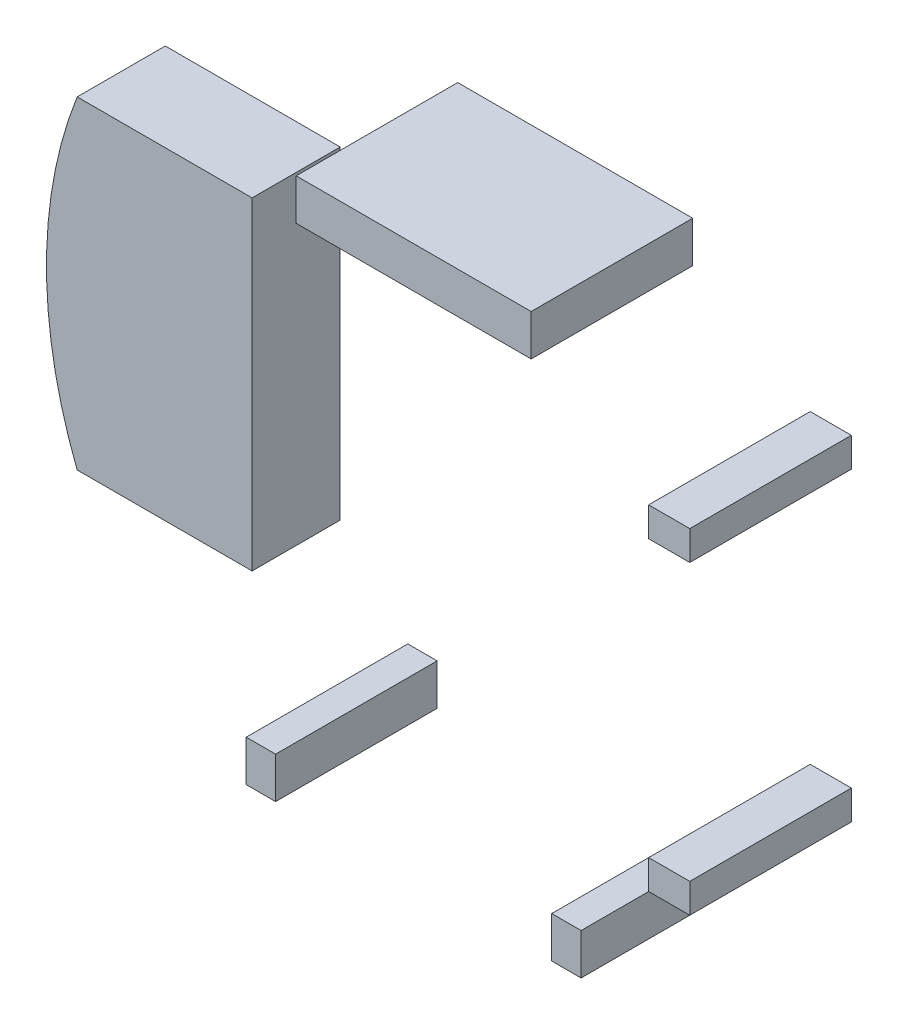
ISO-10303-21;
HEADER;
FILE_DESCRIPTION(('STEP AP214'),'2;1');
FILE_NAME('part.step','',(''),(''),'','','');
FILE_SCHEMA(('AUTOMOTIVE_DESIGN { 1 0 10303 214 1 1 1 1 }'));
ENDSEC;
DATA;
#1=APPLICATION_CONTEXT('core data for automotive mechanical design processes');
#2=APPLICATION_PROTOCOL_DEFINITION('international standard','automotive_design',2000,#1);
#3=PRODUCT_CONTEXT('',#1,'mechanical');
#4=PRODUCT('Part','Part','',(#3));
#5=PRODUCT_RELATED_PRODUCT_CATEGORY('part','',(#4));
#6=PRODUCT_DEFINITION_FORMATION('','',#4);
#7=PRODUCT_DEFINITION_CONTEXT('part definition',#1,'design');
#8=PRODUCT_DEFINITION('design','',#6,#7);
#9=PRODUCT_DEFINITION_SHAPE('','',#8);
#10=(LENGTH_UNIT() NAMED_UNIT(*) SI_UNIT(.MILLI.,.METRE.));
#11=(NAMED_UNIT(*) PLANE_ANGLE_UNIT() SI_UNIT($,.RADIAN.));
#12=(NAMED_UNIT(*) SI_UNIT($,.STERADIAN.) SOLID_ANGLE_UNIT());
#13=UNCERTAINTY_MEASURE_WITH_UNIT(LENGTH_MEASURE(1.E-05),#10,'distance_accuracy_value','');
#14=(GEOMETRIC_REPRESENTATION_CONTEXT(3) GLOBAL_UNCERTAINTY_ASSIGNED_CONTEXT((#13)) GLOBAL_UNIT_ASSIGNED_CONTEXT((#10,
#11,#12)) REPRESENTATION_CONTEXT('',''));
#15=CARTESIAN_POINT('',(0.,0.,0.));
#16=DIRECTION('',(0.,0.,1.));
#17=DIRECTION('',(1.,0.,0.));
#18=AXIS2_PLACEMENT_3D('',#15,#16,#17);
#19=CARTESIAN_POINT('',(9.4,-5.7,0.));
#20=DIRECTION('',(0.,-1.,0.));
#21=DIRECTION('',(0.,0.,-1.));
#22=AXIS2_PLACEMENT_3D('',#19,#20,#21);
#23=PLANE('',#22);
#24=DIRECTION('',(0.,0.,1.));
#25=VECTOR('',#24,1.);
#26=CARTESIAN_POINT('',(8.,-5.7,0.));
#27=LINE('',#26,#25);
#28=CARTESIAN_POINT('',(8.,-5.7,0.));
#29=VERTEX_POINT('',#28);
#30=CARTESIAN_POINT('',(8.,-5.7,5.5));
#31=VERTEX_POINT('',#30);
#32=EDGE_CURVE('P0_E61',#29,#31,#27,.T.);
#33=ORIENTED_EDGE('',*,*,#32,.F.);
#34=DIRECTION('',(1.,0.,0.));
#35=VECTOR('',#34,1.);
#36=CARTESIAN_POINT('',(9.4,-5.7,0.));
#37=LINE('',#36,#35);
#38=CARTESIAN_POINT('',(9.4,-5.7,0.));
#39=VERTEX_POINT('',#38);
#40=EDGE_CURVE('P0_E19',#29,#39,#37,.T.);
#41=ORIENTED_EDGE('',*,*,#40,.T.);
#42=DIRECTION('',(0.,0.,-1.));
#43=VECTOR('',#42,1.);
#44=CARTESIAN_POINT('',(9.4,-5.7,0.));
#45=LINE('',#44,#43);
#46=CARTESIAN_POINT('',(9.4,-5.7,5.5));
#47=VERTEX_POINT('',#46);
#48=EDGE_CURVE('P0_E68',#47,#39,#45,.T.);
#49=ORIENTED_EDGE('',*,*,#48,.F.);
#50=DIRECTION('',(1.,0.,0.));
#51=VECTOR('',#50,1.);
#52=CARTESIAN_POINT('',(8.,-5.7,5.5));
#53=LINE('',#52,#51);
#54=EDGE_CURVE('P0_E55',#31,#47,#53,.T.);
#55=ORIENTED_EDGE('',*,*,#54,.F.);
#56=EDGE_LOOP('',(#33,#41,#49,#55));
#57=FACE_BOUND('',#56,.T.);
#58=ADVANCED_FACE('P0_F16',(#57),#23,.T.);
#59=CARTESIAN_POINT('',(8.,-5.7,0.));
#60=DIRECTION('',(-1.,0.,0.));
#61=DIRECTION('',(0.,0.,1.));
#62=AXIS2_PLACEMENT_3D('',#59,#60,#61);
#63=PLANE('',#62);
#64=DIRECTION('',(0.,0.,1.));
#65=VECTOR('',#64,1.);
#66=CARTESIAN_POINT('',(8.,-4.7,0.));
#67=LINE('',#66,#65);
#68=CARTESIAN_POINT('',(8.,-4.7,0.));
#69=VERTEX_POINT('',#68);
#70=CARTESIAN_POINT('',(8.,-4.7,5.5));
#71=VERTEX_POINT('',#70);
#72=EDGE_CURVE('P0_E82',#69,#71,#67,.T.);
#73=ORIENTED_EDGE('',*,*,#72,.F.);
#74=DIRECTION('',(0.,1.,0.));
#75=VECTOR('',#74,1.);
#76=CARTESIAN_POINT('',(8.,-4.7,0.));
#77=LINE('',#76,#75);
#78=EDGE_CURVE('P0_E66',#69,#29,#77,.F.);
#79=ORIENTED_EDGE('',*,*,#78,.T.);
#80=ORIENTED_EDGE('',*,*,#32,.T.);
#81=DIRECTION('',(0.,1.,0.));
#82=VECTOR('',#81,1.);
#83=CARTESIAN_POINT('',(8.,-4.7,5.5));
#84=LINE('',#83,#82);
#85=EDGE_CURVE('P0_E63',#71,#31,#84,.F.);
#86=ORIENTED_EDGE('',*,*,#85,.F.);
#87=EDGE_LOOP('',(#73,#79,#80,#86));
#88=FACE_BOUND('',#87,.T.);
#89=ADVANCED_FACE('P0_F62',(#88),#63,.T.);
#90=CARTESIAN_POINT('',(8.,-4.7,5.5));
#91=DIRECTION('',(0.,0.,1.));
#92=DIRECTION('',(1.,0.,0.));
#93=AXIS2_PLACEMENT_3D('',#90,#91,#92);
#94=PLANE('',#93);
#95=DIRECTION('',(0.,1.,0.));
#96=VECTOR('',#95,1.);
#97=CARTESIAN_POINT('',(9.4,-4.7,5.5));
#98=LINE('',#97,#96);
#99=CARTESIAN_POINT('',(9.4,-4.7,5.5));
#100=VERTEX_POINT('',#99);
#101=EDGE_CURVE('P0_E70',#100,#47,#98,.F.);
#102=ORIENTED_EDGE('',*,*,#101,.F.);
#103=DIRECTION('',(1.,0.,0.));
#104=VECTOR('',#103,1.);
#105=CARTESIAN_POINT('',(8.,-4.7,5.5));
#106=LINE('',#105,#104);
#107=EDGE_CURVE('P0_E74',#71,#100,#106,.T.);
#108=ORIENTED_EDGE('',*,*,#107,.F.);
#109=ORIENTED_EDGE('',*,*,#85,.T.);
#110=ORIENTED_EDGE('',*,*,#54,.T.);
#111=EDGE_LOOP('',(#102,#108,#109,#110));
#112=FACE_BOUND('',#111,.T.);
#113=ADVANCED_FACE('P0_F72',(#112),#94,.T.);
#114=CARTESIAN_POINT('',(9.4,-4.7,0.));
#115=DIRECTION('',(1.,0.,0.));
#116=DIRECTION('',(0.,0.,-1.));
#117=AXIS2_PLACEMENT_3D('',#114,#115,#116);
#118=PLANE('',#117);
#119=ORIENTED_EDGE('',*,*,#48,.T.);
#120=DIRECTION('',(0.,1.,0.));
#121=VECTOR('',#120,1.);
#122=CARTESIAN_POINT('',(9.4,-4.7,0.));
#123=LINE('',#122,#121);
#124=CARTESIAN_POINT('',(9.4,-4.7,0.));
#125=VERTEX_POINT('',#124);
#126=EDGE_CURVE('P0_E34',#39,#125,#123,.T.);
#127=ORIENTED_EDGE('',*,*,#126,.T.);
#128=DIRECTION('',(0.,0.,1.));
#129=VECTOR('',#128,1.);
#130=CARTESIAN_POINT('',(9.4,-4.7,0.));
#131=LINE('',#130,#129);
#132=EDGE_CURVE('P0_E25',#100,#125,#131,.F.);
#133=ORIENTED_EDGE('',*,*,#132,.F.);
#134=ORIENTED_EDGE('',*,*,#101,.T.);
#135=EDGE_LOOP('',(#119,#127,#133,#134));
#136=FACE_BOUND('',#135,.T.);
#137=ADVANCED_FACE('P0_F88',(#136),#118,.T.);
#138=CARTESIAN_POINT('',(8.,-4.7,0.));
#139=DIRECTION('',(0.,0.,1.));
#140=DIRECTION('',(1.,0.,0.));
#141=AXIS2_PLACEMENT_3D('',#138,#139,#140);
#142=PLANE('',#141);
#143=ORIENTED_EDGE('',*,*,#126,.F.);
#144=ORIENTED_EDGE('',*,*,#40,.F.);
#145=ORIENTED_EDGE('',*,*,#78,.F.);
#146=DIRECTION('',(1.,0.,0.));
#147=VECTOR('',#146,1.);
#148=CARTESIAN_POINT('',(8.,-4.7,0.));
#149=LINE('',#148,#147);
#150=EDGE_CURVE('P0_E11',#125,#69,#149,.F.);
#151=ORIENTED_EDGE('',*,*,#150,.F.);
#152=EDGE_LOOP('',(#143,#144,#145,#151));
#153=FACE_BOUND('',#152,.T.);
#154=ADVANCED_FACE('P0_F90',(#153),#142,.F.);
#155=CARTESIAN_POINT('',(8.,-4.7,0.));
#156=DIRECTION('',(0.,1.,0.));
#157=DIRECTION('',(0.,0.,1.));
#158=AXIS2_PLACEMENT_3D('',#155,#156,#157);
#159=PLANE('',#158);
#160=ORIENTED_EDGE('',*,*,#132,.T.);
#161=ORIENTED_EDGE('',*,*,#150,.T.);
#162=ORIENTED_EDGE('',*,*,#72,.T.);
#163=ORIENTED_EDGE('',*,*,#107,.T.);
#164=EDGE_LOOP('',(#160,#161,#162,#163));
#165=FACE_BOUND('',#164,.T.);
#166=ADVANCED_FACE('P0_F87',(#165),#159,.T.);
#167=CLOSED_SHELL('',(#58,#89,#113,#137,#154,#166));
#168=MANIFOLD_SOLID_BREP('P0_B1',#167);
#169=CARTESIAN_POINT('',(5.7,-9.4,0.));
#170=DIRECTION('',(-1.,0.,0.));
#171=DIRECTION('',(0.,0.,1.));
#172=AXIS2_PLACEMENT_3D('',#169,#170,#171);
#173=PLANE('',#172);
#174=DIRECTION('',(0.,0.,-1.));
#175=VECTOR('',#174,1.);
#176=CARTESIAN_POINT('',(5.7,-8.,0.));
#177=LINE('',#176,#175);
#178=CARTESIAN_POINT('',(5.7,-8.,0.));
#179=VERTEX_POINT('',#178);
#180=CARTESIAN_POINT('',(5.7,-8.,5.5));
#181=VERTEX_POINT('',#180);
#182=EDGE_CURVE('P1_E64',#179,#181,#177,.F.);
#183=ORIENTED_EDGE('',*,*,#182,.T.);
#184=DIRECTION('',(0.,1.,0.));
#185=VECTOR('',#184,1.);
#186=CARTESIAN_POINT('',(5.7,-8.,5.5));
#187=LINE('',#186,#185);
#188=CARTESIAN_POINT('',(5.7,-9.4,5.5));
#189=VERTEX_POINT('',#188);
#190=EDGE_CURVE('P1_E54',#181,#189,#187,.F.);
#191=ORIENTED_EDGE('',*,*,#190,.T.);
#192=DIRECTION('',(0.,0.,1.));
#193=VECTOR('',#192,1.);
#194=CARTESIAN_POINT('',(5.7,-9.4,0.));
#195=LINE('',#194,#193);
#196=CARTESIAN_POINT('',(5.7,-9.4,0.));
#197=VERTEX_POINT('',#196);
#198=EDGE_CURVE('P1_E74',#189,#197,#195,.F.);
#199=ORIENTED_EDGE('',*,*,#198,.T.);
#200=DIRECTION('',(0.,1.,0.));
#201=VECTOR('',#200,1.);
#202=CARTESIAN_POINT('',(5.7,-9.4,0.));
#203=LINE('',#202,#201);
#204=EDGE_CURVE('P1_E19',#179,#197,#203,.F.);
#205=ORIENTED_EDGE('',*,*,#204,.F.);
#206=EDGE_LOOP('',(#183,#191,#199,#205));
#207=FACE_BOUND('',#206,.T.);
#208=ADVANCED_FACE('P1_F16',(#207),#173,.F.);
#209=CARTESIAN_POINT('',(5.7,-8.,0.));
#210=DIRECTION('',(0.,-1.,0.));
#211=DIRECTION('',(0.,0.,-1.));
#212=AXIS2_PLACEMENT_3D('',#209,#210,#211);
#213=PLANE('',#212);
#214=DIRECTION('',(0.,0.,-1.));
#215=VECTOR('',#214,1.);
#216=CARTESIAN_POINT('',(4.7,-8.,0.));
#217=LINE('',#216,#215);
#218=CARTESIAN_POINT('',(4.7,-8.,0.));
#219=VERTEX_POINT('',#218);
#220=CARTESIAN_POINT('',(4.7,-8.,5.5));
#221=VERTEX_POINT('',#220);
#222=EDGE_CURVE('P1_E72',#219,#221,#217,.F.);
#223=ORIENTED_EDGE('',*,*,#222,.T.);
#224=DIRECTION('',(-1.,0.,0.));
#225=VECTOR('',#224,1.);
#226=CARTESIAN_POINT('',(5.7,-8.,5.5));
#227=LINE('',#226,#225);
#228=EDGE_CURVE('P1_E61',#221,#181,#227,.F.);
#229=ORIENTED_EDGE('',*,*,#228,.T.);
#230=ORIENTED_EDGE('',*,*,#182,.F.);
#231=DIRECTION('',(-1.,0.,0.));
#232=VECTOR('',#231,1.);
#233=CARTESIAN_POINT('',(5.7,-8.,0.));
#234=LINE('',#233,#232);
#235=EDGE_CURVE('P1_E79',#219,#179,#234,.F.);
#236=ORIENTED_EDGE('',*,*,#235,.F.);
#237=EDGE_LOOP('',(#223,#229,#230,#236));
#238=FACE_BOUND('',#237,.T.);
#239=ADVANCED_FACE('P1_F71',(#238),#213,.F.);
#240=CARTESIAN_POINT('',(5.7,-8.,5.5));
#241=DIRECTION('',(0.,0.,-1.));
#242=DIRECTION('',(-1.,0.,0.));
#243=AXIS2_PLACEMENT_3D('',#240,#241,#242);
#244=PLANE('',#243);
#245=DIRECTION('',(0.,1.,0.));
#246=VECTOR('',#245,1.);
#247=CARTESIAN_POINT('',(4.7,-8.,5.5));
#248=LINE('',#247,#246);
#249=CARTESIAN_POINT('',(4.7,-9.4,5.5));
#250=VERTEX_POINT('',#249);
#251=EDGE_CURVE('P1_E82',#221,#250,#248,.F.);
#252=ORIENTED_EDGE('',*,*,#251,.T.);
#253=DIRECTION('',(1.,0.,0.));
#254=VECTOR('',#253,1.);
#255=CARTESIAN_POINT('',(4.7,-9.4,5.5));
#256=LINE('',#255,#254);
#257=EDGE_CURVE('P1_E63',#250,#189,#256,.T.);
#258=ORIENTED_EDGE('',*,*,#257,.T.);
#259=ORIENTED_EDGE('',*,*,#190,.F.);
#260=ORIENTED_EDGE('',*,*,#228,.F.);
#261=EDGE_LOOP('',(#252,#258,#259,#260));
#262=FACE_BOUND('',#261,.T.);
#263=ADVANCED_FACE('P1_F59',(#262),#244,.F.);
#264=CARTESIAN_POINT('',(4.7,-9.4,0.));
#265=DIRECTION('',(0.,1.,0.));
#266=DIRECTION('',(0.,0.,1.));
#267=AXIS2_PLACEMENT_3D('',#264,#265,#266);
#268=PLANE('',#267);
#269=ORIENTED_EDGE('',*,*,#198,.F.);
#270=ORIENTED_EDGE('',*,*,#257,.F.);
#271=DIRECTION('',(0.,0.,-1.));
#272=VECTOR('',#271,1.);
#273=CARTESIAN_POINT('',(4.7,-9.4,0.));
#274=LINE('',#273,#272);
#275=CARTESIAN_POINT('',(4.7,-9.4,0.));
#276=VERTEX_POINT('',#275);
#277=EDGE_CURVE('P1_E25',#250,#276,#274,.T.);
#278=ORIENTED_EDGE('',*,*,#277,.T.);
#279=DIRECTION('',(-1.,0.,0.));
#280=VECTOR('',#279,1.);
#281=CARTESIAN_POINT('',(5.7,-9.4,0.));
#282=LINE('',#281,#280);
#283=EDGE_CURVE('P1_E33',#197,#276,#282,.T.);
#284=ORIENTED_EDGE('',*,*,#283,.F.);
#285=EDGE_LOOP('',(#269,#270,#278,#284));
#286=FACE_BOUND('',#285,.T.);
#287=ADVANCED_FACE('P1_F87',(#286),#268,.F.);
#288=CARTESIAN_POINT('',(5.7,-8.,0.));
#289=DIRECTION('',(0.,0.,-1.));
#290=DIRECTION('',(-1.,0.,0.));
#291=AXIS2_PLACEMENT_3D('',#288,#289,#290);
#292=PLANE('',#291);
#293=DIRECTION('',(0.,1.,0.));
#294=VECTOR('',#293,1.);
#295=CARTESIAN_POINT('',(4.7,-8.,0.));
#296=LINE('',#295,#294);
#297=EDGE_CURVE('P1_E11',#276,#219,#296,.T.);
#298=ORIENTED_EDGE('',*,*,#297,.T.);
#299=ORIENTED_EDGE('',*,*,#235,.T.);
#300=ORIENTED_EDGE('',*,*,#204,.T.);
#301=ORIENTED_EDGE('',*,*,#283,.T.);
#302=EDGE_LOOP('',(#298,#299,#300,#301));
#303=FACE_BOUND('',#302,.T.);
#304=ADVANCED_FACE('P1_F90',(#303),#292,.T.);
#305=CARTESIAN_POINT('',(4.7,-8.,0.));
#306=DIRECTION('',(1.,0.,0.));
#307=DIRECTION('',(0.,0.,-1.));
#308=AXIS2_PLACEMENT_3D('',#305,#306,#307);
#309=PLANE('',#308);
#310=ORIENTED_EDGE('',*,*,#277,.F.);
#311=ORIENTED_EDGE('',*,*,#251,.F.);
#312=ORIENTED_EDGE('',*,*,#222,.F.);
#313=ORIENTED_EDGE('',*,*,#297,.F.);
#314=EDGE_LOOP('',(#310,#311,#312,#313));
#315=FACE_BOUND('',#314,.T.);
#316=ADVANCED_FACE('P1_F89',(#315),#309,.F.);
#317=CLOSED_SHELL('',(#208,#239,#263,#287,#304,#316));
#318=MANIFOLD_SOLID_BREP('P1_B1',#317);
#319=CARTESIAN_POINT('',(4.,9.4,0.));
#320=DIRECTION('',(0.,-1.,0.));
#321=DIRECTION('',(0.,0.,-1.));
#322=AXIS2_PLACEMENT_3D('',#319,#320,#321);
#323=PLANE('',#322);
#324=DIRECTION('',(0.,0.,-1.));
#325=VECTOR('',#324,1.);
#326=CARTESIAN_POINT('',(-4.,9.4,0.));
#327=LINE('',#326,#325);
#328=CARTESIAN_POINT('',(-4.,9.4,0.));
#329=VERTEX_POINT('',#328);
#330=CARTESIAN_POINT('',(-4.,9.4,5.5));
#331=VERTEX_POINT('',#330);
#332=EDGE_CURVE('P2_E19',#329,#331,#327,.F.);
#333=ORIENTED_EDGE('',*,*,#332,.T.);
#334=DIRECTION('',(-1.,0.,0.));
#335=VECTOR('',#334,1.);
#336=CARTESIAN_POINT('',(-4.,9.4,5.5));
#337=LINE('',#336,#335);
#338=CARTESIAN_POINT('',(4.,9.4,5.5));
#339=VERTEX_POINT('',#338);
#340=EDGE_CURVE('P2_E54',#331,#339,#337,.F.);
#341=ORIENTED_EDGE('',*,*,#340,.T.);
#342=DIRECTION('',(0.,0.,1.));
#343=VECTOR('',#342,1.);
#344=CARTESIAN_POINT('',(4.,9.4,0.));
#345=LINE('',#344,#343);
#346=CARTESIAN_POINT('',(4.,9.4,0.));
#347=VERTEX_POINT('',#346);
#348=EDGE_CURVE('P2_E75',#339,#347,#345,.F.);
#349=ORIENTED_EDGE('',*,*,#348,.T.);
#350=DIRECTION('',(-1.,0.,0.));
#351=VECTOR('',#350,1.);
#352=CARTESIAN_POINT('',(-4.,9.4,0.));
#353=LINE('',#352,#351);
#354=EDGE_CURVE('P2_E57',#329,#347,#353,.F.);
#355=ORIENTED_EDGE('',*,*,#354,.F.);
#356=EDGE_LOOP('',(#333,#341,#349,#355));
#357=FACE_BOUND('',#356,.T.);
#358=ADVANCED_FACE('P2_F16',(#357),#323,.F.);
#359=CARTESIAN_POINT('',(-4.,9.4,0.));
#360=DIRECTION('',(1.,0.,0.));
#361=DIRECTION('',(0.,0.,-1.));
#362=AXIS2_PLACEMENT_3D('',#359,#360,#361);
#363=PLANE('',#362);
#364=DIRECTION('',(0.,0.,1.));
#365=VECTOR('',#364,1.);
#366=CARTESIAN_POINT('',(-4.,8.,0.));
#367=LINE('',#366,#365);
#368=CARTESIAN_POINT('',(-4.,8.,0.));
#369=VERTEX_POINT('',#368);
#370=CARTESIAN_POINT('',(-4.,8.,5.5));
#371=VERTEX_POINT('',#370);
#372=EDGE_CURVE('P2_E72',#369,#371,#367,.T.);
#373=ORIENTED_EDGE('',*,*,#372,.T.);
#374=DIRECTION('',(0.,1.,0.));
#375=VECTOR('',#374,1.);
#376=CARTESIAN_POINT('',(-4.,8.,5.5));
#377=LINE('',#376,#375);
#378=EDGE_CURVE('P2_E62',#371,#331,#377,.T.);
#379=ORIENTED_EDGE('',*,*,#378,.T.);
#380=ORIENTED_EDGE('',*,*,#332,.F.);
#381=DIRECTION('',(0.,1.,0.));
#382=VECTOR('',#381,1.);
#383=CARTESIAN_POINT('',(-4.,8.,0.));
#384=LINE('',#383,#382);
#385=EDGE_CURVE('P2_E77',#369,#329,#384,.T.);
#386=ORIENTED_EDGE('',*,*,#385,.F.);
#387=EDGE_LOOP('',(#373,#379,#380,#386));
#388=FACE_BOUND('',#387,.T.);
#389=ADVANCED_FACE('P2_F71',(#388),#363,.F.);
#390=CARTESIAN_POINT('',(-4.,8.,5.5));
#391=DIRECTION('',(0.,0.,-1.));
#392=DIRECTION('',(-1.,0.,0.));
#393=AXIS2_PLACEMENT_3D('',#390,#391,#392);
#394=PLANE('',#393);
#395=DIRECTION('',(0.,1.,0.));
#396=VECTOR('',#395,1.);
#397=CARTESIAN_POINT('',(4.,8.,5.5));
#398=LINE('',#397,#396);
#399=CARTESIAN_POINT('',(4.,8.,5.5));
#400=VERTEX_POINT('',#399);
#401=EDGE_CURVE('P2_E68',#400,#339,#398,.T.);
#402=ORIENTED_EDGE('',*,*,#401,.T.);
#403=ORIENTED_EDGE('',*,*,#340,.F.);
#404=ORIENTED_EDGE('',*,*,#378,.F.);
#405=DIRECTION('',(1.,0.,0.));
#406=VECTOR('',#405,1.);
#407=CARTESIAN_POINT('',(-4.,8.,5.5));
#408=LINE('',#407,#406);
#409=EDGE_CURVE('P2_E82',#371,#400,#408,.T.);
#410=ORIENTED_EDGE('',*,*,#409,.T.);
#411=EDGE_LOOP('',(#402,#403,#404,#410));
#412=FACE_BOUND('',#411,.T.);
#413=ADVANCED_FACE('P2_F65',(#412),#394,.F.);
#414=CARTESIAN_POINT('',(4.,8.,0.));
#415=DIRECTION('',(-1.,0.,0.));
#416=DIRECTION('',(0.,0.,1.));
#417=AXIS2_PLACEMENT_3D('',#414,#415,#416);
#418=PLANE('',#417);
#419=ORIENTED_EDGE('',*,*,#348,.F.);
#420=ORIENTED_EDGE('',*,*,#401,.F.);
#421=DIRECTION('',(0.,0.,1.));
#422=VECTOR('',#421,1.);
#423=CARTESIAN_POINT('',(4.,8.,0.));
#424=LINE('',#423,#422);
#425=CARTESIAN_POINT('',(4.,8.,0.));
#426=VERTEX_POINT('',#425);
#427=EDGE_CURVE('P2_E25',#400,#426,#424,.F.);
#428=ORIENTED_EDGE('',*,*,#427,.T.);
#429=DIRECTION('',(0.,1.,0.));
#430=VECTOR('',#429,1.);
#431=CARTESIAN_POINT('',(4.,8.,0.));
#432=LINE('',#431,#430);
#433=EDGE_CURVE('P2_E33',#347,#426,#432,.F.);
#434=ORIENTED_EDGE('',*,*,#433,.F.);
#435=EDGE_LOOP('',(#419,#420,#428,#434));
#436=FACE_BOUND('',#435,.T.);
#437=ADVANCED_FACE('P2_F87',(#436),#418,.F.);
#438=CARTESIAN_POINT('',(-4.,8.,0.));
#439=DIRECTION('',(0.,0.,-1.));
#440=DIRECTION('',(-1.,0.,0.));
#441=AXIS2_PLACEMENT_3D('',#438,#439,#440);
#442=PLANE('',#441);
#443=ORIENTED_EDGE('',*,*,#433,.T.);
#444=DIRECTION('',(1.,0.,0.));
#445=VECTOR('',#444,1.);
#446=CARTESIAN_POINT('',(-4.,8.,0.));
#447=LINE('',#446,#445);
#448=EDGE_CURVE('P2_E11',#426,#369,#447,.F.);
#449=ORIENTED_EDGE('',*,*,#448,.T.);
#450=ORIENTED_EDGE('',*,*,#385,.T.);
#451=ORIENTED_EDGE('',*,*,#354,.T.);
#452=EDGE_LOOP('',(#443,#449,#450,#451));
#453=FACE_BOUND('',#452,.T.);
#454=ADVANCED_FACE('P2_F90',(#453),#442,.T.);
#455=CARTESIAN_POINT('',(-4.,8.,0.));
#456=DIRECTION('',(0.,1.,0.));
#457=DIRECTION('',(0.,0.,1.));
#458=AXIS2_PLACEMENT_3D('',#455,#456,#457);
#459=PLANE('',#458);
#460=ORIENTED_EDGE('',*,*,#427,.F.);
#461=ORIENTED_EDGE('',*,*,#409,.F.);
#462=ORIENTED_EDGE('',*,*,#372,.F.);
#463=ORIENTED_EDGE('',*,*,#448,.F.);
#464=EDGE_LOOP('',(#460,#461,#462,#463));
#465=FACE_BOUND('',#464,.T.);
#466=ADVANCED_FACE('P2_F89',(#465),#459,.F.);
#467=CLOSED_SHELL('',(#358,#389,#413,#437,#454,#466));
#468=MANIFOLD_SOLID_BREP('P2_B1',#467);
#469=CARTESIAN_POINT('',(-4.7,-9.4,0.));
#470=DIRECTION('',(-1.,0.,0.));
#471=DIRECTION('',(0.,0.,1.));
#472=AXIS2_PLACEMENT_3D('',#469,#470,#471);
#473=PLANE('',#472);
#474=DIRECTION('',(0.,0.,-1.));
#475=VECTOR('',#474,1.);
#476=CARTESIAN_POINT('',(-4.7,-8.,0.));
#477=LINE('',#476,#475);
#478=CARTESIAN_POINT('',(-4.7,-8.,0.));
#479=VERTEX_POINT('',#478);
#480=CARTESIAN_POINT('',(-4.7,-8.,5.5));
#481=VERTEX_POINT('',#480);
#482=EDGE_CURVE('P3_E64',#479,#481,#477,.F.);
#483=ORIENTED_EDGE('',*,*,#482,.T.);
#484=DIRECTION('',(0.,1.,0.));
#485=VECTOR('',#484,1.);
#486=CARTESIAN_POINT('',(-4.7,-8.,5.5));
#487=LINE('',#486,#485);
#488=CARTESIAN_POINT('',(-4.7,-9.4,5.5));
#489=VERTEX_POINT('',#488);
#490=EDGE_CURVE('P3_E54',#481,#489,#487,.F.);
#491=ORIENTED_EDGE('',*,*,#490,.T.);
#492=DIRECTION('',(0.,0.,1.));
#493=VECTOR('',#492,1.);
#494=CARTESIAN_POINT('',(-4.7,-9.4,0.));
#495=LINE('',#494,#493);
#496=CARTESIAN_POINT('',(-4.7,-9.4,0.));
#497=VERTEX_POINT('',#496);
#498=EDGE_CURVE('P3_E74',#489,#497,#495,.F.);
#499=ORIENTED_EDGE('',*,*,#498,.T.);
#500=DIRECTION('',(0.,1.,0.));
#501=VECTOR('',#500,1.);
#502=CARTESIAN_POINT('',(-4.7,-9.4,0.));
#503=LINE('',#502,#501);
#504=EDGE_CURVE('P3_E19',#479,#497,#503,.F.);
#505=ORIENTED_EDGE('',*,*,#504,.F.);
#506=EDGE_LOOP('',(#483,#491,#499,#505));
#507=FACE_BOUND('',#506,.T.);
#508=ADVANCED_FACE('P3_F16',(#507),#473,.F.);
#509=CARTESIAN_POINT('',(-4.7,-8.,0.));
#510=DIRECTION('',(0.,-1.,0.));
#511=DIRECTION('',(0.,0.,-1.));
#512=AXIS2_PLACEMENT_3D('',#509,#510,#511);
#513=PLANE('',#512);
#514=DIRECTION('',(0.,0.,-1.));
#515=VECTOR('',#514,1.);
#516=CARTESIAN_POINT('',(-5.7,-8.,0.));
#517=LINE('',#516,#515);
#518=CARTESIAN_POINT('',(-5.7,-8.,0.));
#519=VERTEX_POINT('',#518);
#520=CARTESIAN_POINT('',(-5.7,-8.,5.5));
#521=VERTEX_POINT('',#520);
#522=EDGE_CURVE('P3_E72',#519,#521,#517,.F.);
#523=ORIENTED_EDGE('',*,*,#522,.T.);
#524=DIRECTION('',(-1.,0.,0.));
#525=VECTOR('',#524,1.);
#526=CARTESIAN_POINT('',(-4.7,-8.,5.5));
#527=LINE('',#526,#525);
#528=EDGE_CURVE('P3_E61',#521,#481,#527,.F.);
#529=ORIENTED_EDGE('',*,*,#528,.T.);
#530=ORIENTED_EDGE('',*,*,#482,.F.);
#531=DIRECTION('',(-1.,0.,0.));
#532=VECTOR('',#531,1.);
#533=CARTESIAN_POINT('',(-4.7,-8.,0.));
#534=LINE('',#533,#532);
#535=EDGE_CURVE('P3_E79',#519,#479,#534,.F.);
#536=ORIENTED_EDGE('',*,*,#535,.F.);
#537=EDGE_LOOP('',(#523,#529,#530,#536));
#538=FACE_BOUND('',#537,.T.);
#539=ADVANCED_FACE('P3_F71',(#538),#513,.F.);
#540=CARTESIAN_POINT('',(-4.7,-8.,5.5));
#541=DIRECTION('',(0.,0.,-1.));
#542=DIRECTION('',(-1.,0.,0.));
#543=AXIS2_PLACEMENT_3D('',#540,#541,#542);
#544=PLANE('',#543);
#545=DIRECTION('',(0.,1.,0.));
#546=VECTOR('',#545,1.);
#547=CARTESIAN_POINT('',(-5.7,-8.,5.5));
#548=LINE('',#547,#546);
#549=CARTESIAN_POINT('',(-5.7,-9.4,5.5));
#550=VERTEX_POINT('',#549);
#551=EDGE_CURVE('P3_E82',#521,#550,#548,.F.);
#552=ORIENTED_EDGE('',*,*,#551,.T.);
#553=DIRECTION('',(1.,0.,0.));
#554=VECTOR('',#553,1.);
#555=CARTESIAN_POINT('',(-5.7,-9.4,5.5));
#556=LINE('',#555,#554);
#557=EDGE_CURVE('P3_E63',#550,#489,#556,.T.);
#558=ORIENTED_EDGE('',*,*,#557,.T.);
#559=ORIENTED_EDGE('',*,*,#490,.F.);
#560=ORIENTED_EDGE('',*,*,#528,.F.);
#561=EDGE_LOOP('',(#552,#558,#559,#560));
#562=FACE_BOUND('',#561,.T.);
#563=ADVANCED_FACE('P3_F59',(#562),#544,.F.);
#564=CARTESIAN_POINT('',(-5.7,-9.4,0.));
#565=DIRECTION('',(0.,1.,0.));
#566=DIRECTION('',(0.,0.,1.));
#567=AXIS2_PLACEMENT_3D('',#564,#565,#566);
#568=PLANE('',#567);
#569=ORIENTED_EDGE('',*,*,#498,.F.);
#570=ORIENTED_EDGE('',*,*,#557,.F.);
#571=DIRECTION('',(0.,0.,-1.));
#572=VECTOR('',#571,1.);
#573=CARTESIAN_POINT('',(-5.7,-9.4,0.));
#574=LINE('',#573,#572);
#575=CARTESIAN_POINT('',(-5.7,-9.4,0.));
#576=VERTEX_POINT('',#575);
#577=EDGE_CURVE('P3_E25',#550,#576,#574,.T.);
#578=ORIENTED_EDGE('',*,*,#577,.T.);
#579=DIRECTION('',(-1.,0.,0.));
#580=VECTOR('',#579,1.);
#581=CARTESIAN_POINT('',(-4.7,-9.4,0.));
#582=LINE('',#581,#580);
#583=EDGE_CURVE('P3_E33',#497,#576,#582,.T.);
#584=ORIENTED_EDGE('',*,*,#583,.F.);
#585=EDGE_LOOP('',(#569,#570,#578,#584));
#586=FACE_BOUND('',#585,.T.);
#587=ADVANCED_FACE('P3_F87',(#586),#568,.F.);
#588=CARTESIAN_POINT('',(-4.7,-8.,0.));
#589=DIRECTION('',(0.,0.,-1.));
#590=DIRECTION('',(-1.,0.,0.));
#591=AXIS2_PLACEMENT_3D('',#588,#589,#590);
#592=PLANE('',#591);
#593=DIRECTION('',(0.,1.,0.));
#594=VECTOR('',#593,1.);
#595=CARTESIAN_POINT('',(-5.7,-8.,0.));
#596=LINE('',#595,#594);
#597=EDGE_CURVE('P3_E11',#576,#519,#596,.T.);
#598=ORIENTED_EDGE('',*,*,#597,.T.);
#599=ORIENTED_EDGE('',*,*,#535,.T.);
#600=ORIENTED_EDGE('',*,*,#504,.T.);
#601=ORIENTED_EDGE('',*,*,#583,.T.);
#602=EDGE_LOOP('',(#598,#599,#600,#601));
#603=FACE_BOUND('',#602,.T.);
#604=ADVANCED_FACE('P3_F90',(#603),#592,.T.);
#605=CARTESIAN_POINT('',(-5.7,-8.,0.));
#606=DIRECTION('',(1.,0.,0.));
#607=DIRECTION('',(0.,0.,-1.));
#608=AXIS2_PLACEMENT_3D('',#605,#606,#607);
#609=PLANE('',#608);
#610=ORIENTED_EDGE('',*,*,#577,.F.);
#611=ORIENTED_EDGE('',*,*,#551,.F.);
#612=ORIENTED_EDGE('',*,*,#522,.F.);
#613=ORIENTED_EDGE('',*,*,#597,.F.);
#614=EDGE_LOOP('',(#610,#611,#612,#613));
#615=FACE_BOUND('',#614,.T.);
#616=ADVANCED_FACE('P3_F89',(#615),#609,.F.);
#617=CLOSED_SHELL('',(#508,#539,#563,#587,#604,#616));
#618=MANIFOLD_SOLID_BREP('P3_B1',#617);
#619=CARTESIAN_POINT('',(-13.95528573695,5.499999999999,3.));
#620=DIRECTION('',(0.,0.,-1.));
#621=DIRECTION('',(-1.,0.,0.));
#622=AXIS2_PLACEMENT_3D('',#619,#620,#621);
#623=PLANE('',#622);
#624=DIRECTION('',(1.,0.,0.));
#625=VECTOR('',#624,1.);
#626=CARTESIAN_POINT('',(-8.,-5.5,3.));
#627=LINE('',#626,#625);
#628=CARTESIAN_POINT('',(-8.,-5.5,3.));
#629=VERTEX_POINT('',#628);
#630=CARTESIAN_POINT('',(-13.9552857369527,-5.50000000000049,3.));
#631=VERTEX_POINT('',#630);
#632=EDGE_CURVE('P4_E48',#629,#631,#627,.F.);
#633=ORIENTED_EDGE('',*,*,#632,.F.);
#634=DIRECTION('',(0.,1.,0.));
#635=VECTOR('',#634,1.);
#636=CARTESIAN_POINT('',(-8.,5.5,3.));
#637=LINE('',#636,#635);
#638=CARTESIAN_POINT('',(-8.,5.5,3.));
#639=VERTEX_POINT('',#638);
#640=EDGE_CURVE('P4_E56',#639,#629,#637,.F.);
#641=ORIENTED_EDGE('',*,*,#640,.F.);
#642=DIRECTION('',(1.,0.,0.));
#643=VECTOR('',#642,1.);
#644=CARTESIAN_POINT('',(-13.95528573695,5.5,3.));
#645=LINE('',#644,#643);
#646=CARTESIAN_POINT('',(-13.9552857369527,5.50000000000049,3.));
#647=VERTEX_POINT('',#646);
#648=EDGE_CURVE('P4_E67',#647,#639,#645,.T.);
#649=ORIENTED_EDGE('',*,*,#648,.F.);
#650=CARTESIAN_POINT('',(0.,0.,3.));
#651=DIRECTION('',(0.,0.,-1.));
#652=DIRECTION('',(-1.,0.,0.));
#653=AXIS2_PLACEMENT_3D('',#650,#651,#652);
#654=CIRCLE('',#653,15.);
#655=EDGE_CURVE('P4_E19',#631,#647,#654,.T.);
#656=ORIENTED_EDGE('',*,*,#655,.F.);
#657=EDGE_LOOP('',(#633,#641,#649,#656));
#658=FACE_BOUND('',#657,.T.);
#659=ADVANCED_FACE('P4_F16',(#658),#623,.F.);
#660=CARTESIAN_POINT('',(-13.95528573695,5.5,0.));
#661=DIRECTION('',(0.,1.,0.));
#662=DIRECTION('',(0.,0.,1.));
#663=AXIS2_PLACEMENT_3D('',#660,#661,#662);
#664=PLANE('',#663);
#665=DIRECTION('',(0.,0.,-1.));
#666=VECTOR('',#665,1.);
#667=CARTESIAN_POINT('',(-8.,5.5,0.));
#668=LINE('',#667,#666);
#669=CARTESIAN_POINT('',(-8.,5.5,0.));
#670=VERTEX_POINT('',#669);
#671=EDGE_CURVE('P4_E60',#670,#639,#668,.F.);
#672=ORIENTED_EDGE('',*,*,#671,.F.);
#673=DIRECTION('',(-1.,0.,0.));
#674=VECTOR('',#673,1.);
#675=CARTESIAN_POINT('',(-13.95528573695,5.5,0.));
#676=LINE('',#675,#674);
#677=CARTESIAN_POINT('',(-13.9552857369527,5.50000000000049,0.));
#678=VERTEX_POINT('',#677);
#679=EDGE_CURVE('P4_E65',#678,#670,#676,.F.);
#680=ORIENTED_EDGE('',*,*,#679,.F.);
#681=DIRECTION('',(0.,0.,-1.));
#682=VECTOR('',#681,1.);
#683=CARTESIAN_POINT('',(-13.9552857369525,5.50000000000098,0.));
#684=LINE('',#683,#682);
#685=EDGE_CURVE('P4_E77',#647,#678,#684,.T.);
#686=ORIENTED_EDGE('',*,*,#685,.F.);
#687=ORIENTED_EDGE('',*,*,#648,.T.);
#688=EDGE_LOOP('',(#672,#680,#686,#687));
#689=FACE_BOUND('',#688,.T.);
#690=ADVANCED_FACE('P4_F62',(#689),#664,.T.);
#691=CARTESIAN_POINT('',(-8.,5.5,0.));
#692=DIRECTION('',(1.,0.,0.));
#693=DIRECTION('',(0.,0.,-1.));
#694=AXIS2_PLACEMENT_3D('',#691,#692,#693);
#695=PLANE('',#694);
#696=DIRECTION('',(0.,0.,-1.));
#697=VECTOR('',#696,1.);
#698=CARTESIAN_POINT('',(-8.,-5.5,0.));
#699=LINE('',#698,#697);
#700=CARTESIAN_POINT('',(-8.,-5.5,0.));
#701=VERTEX_POINT('',#700);
#702=EDGE_CURVE('P4_E72',#701,#629,#699,.F.);
#703=ORIENTED_EDGE('',*,*,#702,.F.);
#704=DIRECTION('',(0.,1.,0.));
#705=VECTOR('',#704,1.);
#706=CARTESIAN_POINT('',(-8.,5.499999999999,0.));
#707=LINE('',#706,#705);
#708=EDGE_CURVE('P4_E70',#670,#701,#707,.F.);
#709=ORIENTED_EDGE('',*,*,#708,.F.);
#710=ORIENTED_EDGE('',*,*,#671,.T.);
#711=ORIENTED_EDGE('',*,*,#640,.T.);
#712=EDGE_LOOP('',(#703,#709,#710,#711));
#713=FACE_BOUND('',#712,.T.);
#714=ADVANCED_FACE('P4_F71',(#713),#695,.T.);
#715=CARTESIAN_POINT('',(-8.,-5.5,0.));
#716=DIRECTION('',(0.,-1.,0.));
#717=DIRECTION('',(0.,0.,-1.));
#718=AXIS2_PLACEMENT_3D('',#715,#716,#717);
#719=PLANE('',#718);
#720=DIRECTION('',(0.,0.,-1.));
#721=VECTOR('',#720,1.);
#722=CARTESIAN_POINT('',(-13.9552857369525,-5.50000000000098,0.));
#723=LINE('',#722,#721);
#724=CARTESIAN_POINT('',(-13.9552857369527,-5.50000000000049,0.));
#725=VERTEX_POINT('',#724);
#726=EDGE_CURVE('P4_E33',#725,#631,#723,.F.);
#727=ORIENTED_EDGE('',*,*,#726,.F.);
#728=DIRECTION('',(-1.,0.,0.));
#729=VECTOR('',#728,1.);
#730=CARTESIAN_POINT('',(-13.95528573695,-5.5,0.));
#731=LINE('',#730,#729);
#732=EDGE_CURVE('P4_E25',#701,#725,#731,.T.);
#733=ORIENTED_EDGE('',*,*,#732,.F.);
#734=ORIENTED_EDGE('',*,*,#702,.T.);
#735=ORIENTED_EDGE('',*,*,#632,.T.);
#736=EDGE_LOOP('',(#727,#733,#734,#735));
#737=FACE_BOUND('',#736,.T.);
#738=ADVANCED_FACE('P4_F102',(#737),#719,.T.);
#739=CARTESIAN_POINT('',(0.,0.,0.));
#740=DIRECTION('',(0.,0.,-1.));
#741=DIRECTION('',(-1.,0.,0.));
#742=AXIS2_PLACEMENT_3D('',#739,#740,#741);
#743=CYLINDRICAL_SURFACE('',#742,15.);
#744=ORIENTED_EDGE('',*,*,#655,.T.);
#745=ORIENTED_EDGE('',*,*,#685,.T.);
#746=CARTESIAN_POINT('',(0.,0.,0.));
#747=DIRECTION('',(0.,0.,-1.));
#748=DIRECTION('',(-1.,0.,0.));
#749=AXIS2_PLACEMENT_3D('',#746,#747,#748);
#750=CIRCLE('',#749,15.);
#751=EDGE_CURVE('P4_E11',#725,#678,#750,.T.);
#752=ORIENTED_EDGE('',*,*,#751,.F.);
#753=ORIENTED_EDGE('',*,*,#726,.T.);
#754=EDGE_LOOP('',(#744,#745,#752,#753));
#755=FACE_BOUND('',#754,.T.);
#756=ADVANCED_FACE('P4_F104',(#755),#743,.T.);
#757=CARTESIAN_POINT('',(-13.95528573695,5.499999999999,0.));
#758=DIRECTION('',(0.,0.,-1.));
#759=DIRECTION('',(-1.,0.,0.));
#760=AXIS2_PLACEMENT_3D('',#757,#758,#759);
#761=PLANE('',#760);
#762=ORIENTED_EDGE('',*,*,#732,.T.);
#763=ORIENTED_EDGE('',*,*,#751,.T.);
#764=ORIENTED_EDGE('',*,*,#679,.T.);
#765=ORIENTED_EDGE('',*,*,#708,.T.);
#766=EDGE_LOOP('',(#762,#763,#764,#765));
#767=FACE_BOUND('',#766,.T.);
#768=ADVANCED_FACE('P4_F76',(#767),#761,.T.);
#769=CLOSED_SHELL('',(#659,#690,#714,#738,#756,#768));
#770=MANIFOLD_SOLID_BREP('P4_B1',#769);
#771=CARTESIAN_POINT('',(9.4,4.7,0.));
#772=DIRECTION('',(0.,-1.,0.));
#773=DIRECTION('',(0.,0.,-1.));
#774=AXIS2_PLACEMENT_3D('',#771,#772,#773);
#775=PLANE('',#774);
#776=DIRECTION('',(0.,0.,1.));
#777=VECTOR('',#776,1.);
#778=CARTESIAN_POINT('',(8.,4.7,0.));
#779=LINE('',#778,#777);
#780=CARTESIAN_POINT('',(8.,4.7,0.));
#781=VERTEX_POINT('',#780);
#782=CARTESIAN_POINT('',(8.,4.7,5.5));
#783=VERTEX_POINT('',#782);
#784=EDGE_CURVE('P5_E61',#781,#783,#779,.T.);
#785=ORIENTED_EDGE('',*,*,#784,.F.);
#786=DIRECTION('',(1.,0.,0.));
#787=VECTOR('',#786,1.);
#788=CARTESIAN_POINT('',(9.4,4.7,0.));
#789=LINE('',#788,#787);
#790=CARTESIAN_POINT('',(9.4,4.7,0.));
#791=VERTEX_POINT('',#790);
#792=EDGE_CURVE('P5_E19',#781,#791,#789,.T.);
#793=ORIENTED_EDGE('',*,*,#792,.T.);
#794=DIRECTION('',(0.,0.,-1.));
#795=VECTOR('',#794,1.);
#796=CARTESIAN_POINT('',(9.4,4.7,0.));
#797=LINE('',#796,#795);
#798=CARTESIAN_POINT('',(9.4,4.7,5.5));
#799=VERTEX_POINT('',#798);
#800=EDGE_CURVE('P5_E68',#799,#791,#797,.T.);
#801=ORIENTED_EDGE('',*,*,#800,.F.);
#802=DIRECTION('',(1.,0.,0.));
#803=VECTOR('',#802,1.);
#804=CARTESIAN_POINT('',(8.,4.7,5.5));
#805=LINE('',#804,#803);
#806=EDGE_CURVE('P5_E55',#783,#799,#805,.T.);
#807=ORIENTED_EDGE('',*,*,#806,.F.);
#808=EDGE_LOOP('',(#785,#793,#801,#807));
#809=FACE_BOUND('',#808,.T.);
#810=ADVANCED_FACE('P5_F16',(#809),#775,.T.);
#811=CARTESIAN_POINT('',(8.,4.7,0.));
#812=DIRECTION('',(-1.,0.,0.));
#813=DIRECTION('',(0.,0.,1.));
#814=AXIS2_PLACEMENT_3D('',#811,#812,#813);
#815=PLANE('',#814);
#816=DIRECTION('',(0.,0.,1.));
#817=VECTOR('',#816,1.);
#818=CARTESIAN_POINT('',(8.,5.7,0.));
#819=LINE('',#818,#817);
#820=CARTESIAN_POINT('',(8.,5.7,0.));
#821=VERTEX_POINT('',#820);
#822=CARTESIAN_POINT('',(8.,5.7,5.5));
#823=VERTEX_POINT('',#822);
#824=EDGE_CURVE('P5_E82',#821,#823,#819,.T.);
#825=ORIENTED_EDGE('',*,*,#824,.F.);
#826=DIRECTION('',(0.,1.,0.));
#827=VECTOR('',#826,1.);
#828=CARTESIAN_POINT('',(8.,5.7,0.));
#829=LINE('',#828,#827);
#830=EDGE_CURVE('P5_E66',#821,#781,#829,.F.);
#831=ORIENTED_EDGE('',*,*,#830,.T.);
#832=ORIENTED_EDGE('',*,*,#784,.T.);
#833=DIRECTION('',(0.,1.,0.));
#834=VECTOR('',#833,1.);
#835=CARTESIAN_POINT('',(8.,5.7,5.5));
#836=LINE('',#835,#834);
#837=EDGE_CURVE('P5_E63',#823,#783,#836,.F.);
#838=ORIENTED_EDGE('',*,*,#837,.F.);
#839=EDGE_LOOP('',(#825,#831,#832,#838));
#840=FACE_BOUND('',#839,.T.);
#841=ADVANCED_FACE('P5_F62',(#840),#815,.T.);
#842=CARTESIAN_POINT('',(8.,5.7,5.5));
#843=DIRECTION('',(0.,0.,1.));
#844=DIRECTION('',(1.,0.,0.));
#845=AXIS2_PLACEMENT_3D('',#842,#843,#844);
#846=PLANE('',#845);
#847=DIRECTION('',(0.,1.,0.));
#848=VECTOR('',#847,1.);
#849=CARTESIAN_POINT('',(9.4,5.7,5.5));
#850=LINE('',#849,#848);
#851=CARTESIAN_POINT('',(9.4,5.7,5.5));
#852=VERTEX_POINT('',#851);
#853=EDGE_CURVE('P5_E70',#852,#799,#850,.F.);
#854=ORIENTED_EDGE('',*,*,#853,.F.);
#855=DIRECTION('',(1.,0.,0.));
#856=VECTOR('',#855,1.);
#857=CARTESIAN_POINT('',(8.,5.7,5.5));
#858=LINE('',#857,#856);
#859=EDGE_CURVE('P5_E74',#823,#852,#858,.T.);
#860=ORIENTED_EDGE('',*,*,#859,.F.);
#861=ORIENTED_EDGE('',*,*,#837,.T.);
#862=ORIENTED_EDGE('',*,*,#806,.T.);
#863=EDGE_LOOP('',(#854,#860,#861,#862));
#864=FACE_BOUND('',#863,.T.);
#865=ADVANCED_FACE('P5_F72',(#864),#846,.T.);
#866=CARTESIAN_POINT('',(9.4,5.7,0.));
#867=DIRECTION('',(1.,0.,0.));
#868=DIRECTION('',(0.,0.,-1.));
#869=AXIS2_PLACEMENT_3D('',#866,#867,#868);
#870=PLANE('',#869);
#871=ORIENTED_EDGE('',*,*,#800,.T.);
#872=DIRECTION('',(0.,1.,0.));
#873=VECTOR('',#872,1.);
#874=CARTESIAN_POINT('',(9.4,5.7,0.));
#875=LINE('',#874,#873);
#876=CARTESIAN_POINT('',(9.4,5.7,0.));
#877=VERTEX_POINT('',#876);
#878=EDGE_CURVE('P5_E34',#791,#877,#875,.T.);
#879=ORIENTED_EDGE('',*,*,#878,.T.);
#880=DIRECTION('',(0.,0.,1.));
#881=VECTOR('',#880,1.);
#882=CARTESIAN_POINT('',(9.4,5.7,0.));
#883=LINE('',#882,#881);
#884=EDGE_CURVE('P5_E25',#852,#877,#883,.F.);
#885=ORIENTED_EDGE('',*,*,#884,.F.);
#886=ORIENTED_EDGE('',*,*,#853,.T.);
#887=EDGE_LOOP('',(#871,#879,#885,#886));
#888=FACE_BOUND('',#887,.T.);
#889=ADVANCED_FACE('P5_F88',(#888),#870,.T.);
#890=CARTESIAN_POINT('',(8.,5.7,0.));
#891=DIRECTION('',(0.,0.,1.));
#892=DIRECTION('',(1.,0.,0.));
#893=AXIS2_PLACEMENT_3D('',#890,#891,#892);
#894=PLANE('',#893);
#895=ORIENTED_EDGE('',*,*,#878,.F.);
#896=ORIENTED_EDGE('',*,*,#792,.F.);
#897=ORIENTED_EDGE('',*,*,#830,.F.);
#898=DIRECTION('',(1.,0.,0.));
#899=VECTOR('',#898,1.);
#900=CARTESIAN_POINT('',(8.,5.7,0.));
#901=LINE('',#900,#899);
#902=EDGE_CURVE('P5_E11',#877,#821,#901,.F.);
#903=ORIENTED_EDGE('',*,*,#902,.F.);
#904=EDGE_LOOP('',(#895,#896,#897,#903));
#905=FACE_BOUND('',#904,.T.);
#906=ADVANCED_FACE('P5_F90',(#905),#894,.F.);
#907=CARTESIAN_POINT('',(8.,5.7,0.));
#908=DIRECTION('',(0.,1.,0.));
#909=DIRECTION('',(0.,0.,1.));
#910=AXIS2_PLACEMENT_3D('',#907,#908,#909);
#911=PLANE('',#910);
#912=ORIENTED_EDGE('',*,*,#884,.T.);
#913=ORIENTED_EDGE('',*,*,#902,.T.);
#914=ORIENTED_EDGE('',*,*,#824,.T.);
#915=ORIENTED_EDGE('',*,*,#859,.T.);
#916=EDGE_LOOP('',(#912,#913,#914,#915));
#917=FACE_BOUND('',#916,.T.);
#918=ADVANCED_FACE('P5_F87',(#917),#911,.T.);
#919=CLOSED_SHELL('',(#810,#841,#865,#889,#906,#918));
#920=MANIFOLD_SOLID_BREP('P5_B1',#919);
#921=ADVANCED_BREP_SHAPE_REPRESENTATION('',(#18,#168,#318,#468,#618,#770,#920),#14);
#922=SHAPE_DEFINITION_REPRESENTATION(#9,#921);
ENDSEC;
END-ISO-10303-21;
